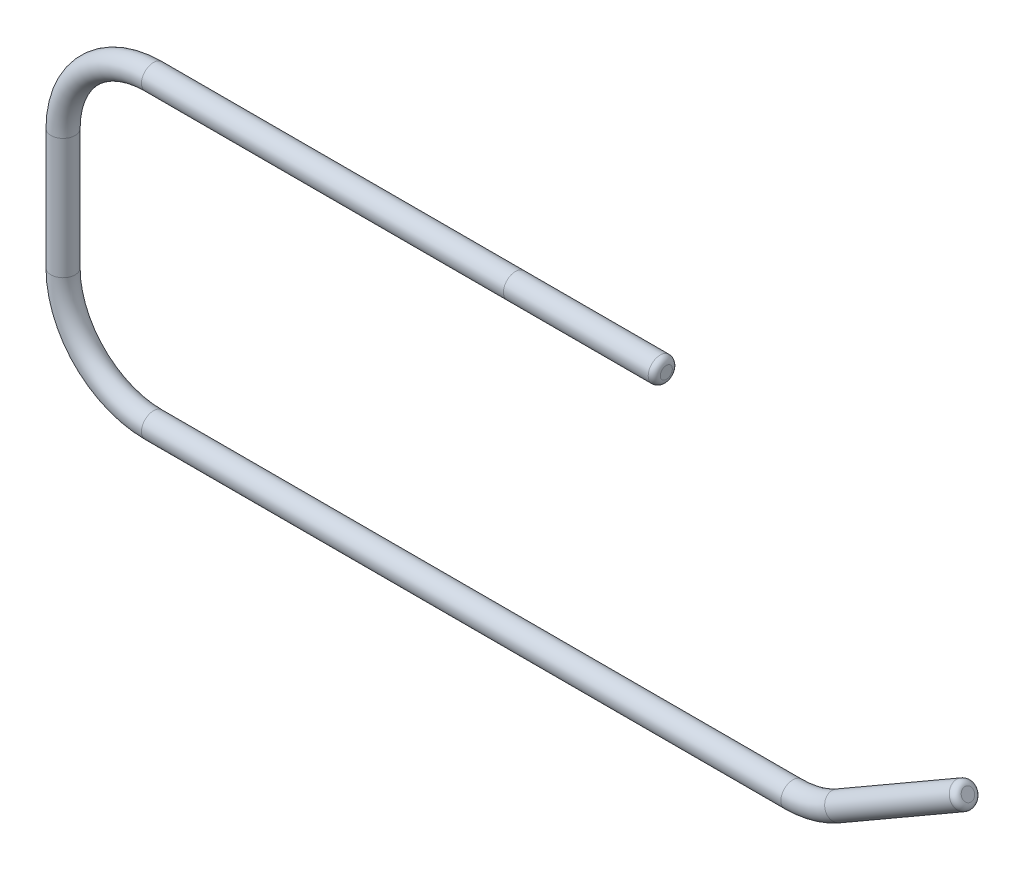
ISO-10303-21;
HEADER;
FILE_DESCRIPTION(('STEP AP214'),'2;1');
FILE_NAME('part.step','',(''),(''),'','','');
FILE_SCHEMA(('AUTOMOTIVE_DESIGN { 1 0 10303 214 1 1 1 1 }'));
ENDSEC;
DATA;
#1=APPLICATION_CONTEXT('core data for automotive mechanical design processes');
#2=APPLICATION_PROTOCOL_DEFINITION('international standard','automotive_design',2000,#1);
#3=PRODUCT_CONTEXT('',#1,'mechanical');
#4=PRODUCT('Part','Part','',(#3));
#5=PRODUCT_RELATED_PRODUCT_CATEGORY('part','',(#4));
#6=PRODUCT_DEFINITION_FORMATION('','',#4);
#7=PRODUCT_DEFINITION_CONTEXT('part definition',#1,'design');
#8=PRODUCT_DEFINITION('design','',#6,#7);
#9=PRODUCT_DEFINITION_SHAPE('','',#8);
#10=(LENGTH_UNIT() NAMED_UNIT(*) SI_UNIT(.MILLI.,.METRE.));
#11=(NAMED_UNIT(*) PLANE_ANGLE_UNIT() SI_UNIT($,.RADIAN.));
#12=(NAMED_UNIT(*) SI_UNIT($,.STERADIAN.) SOLID_ANGLE_UNIT());
#13=UNCERTAINTY_MEASURE_WITH_UNIT(LENGTH_MEASURE(1.E-05),#10,'distance_accuracy_value','');
#14=(GEOMETRIC_REPRESENTATION_CONTEXT(3) GLOBAL_UNCERTAINTY_ASSIGNED_CONTEXT((#13)) GLOBAL_UNIT_ASSIGNED_CONTEXT((#10,
#11,#12)) REPRESENTATION_CONTEXT('',''));
#15=CARTESIAN_POINT('',(0.,0.,0.));
#16=DIRECTION('',(0.,0.,1.));
#17=DIRECTION('',(1.,0.,0.));
#18=AXIS2_PLACEMENT_3D('',#15,#16,#17);
#19=CARTESIAN_POINT('',(50.,0.,0.));
#20=DIRECTION('',(1.,0.,0.));
#21=DIRECTION('',(0.,1.,0.));
#22=AXIS2_PLACEMENT_3D('',#19,#20,#21);
#23=PLANE('',#22);
#24=CARTESIAN_POINT('',(50.,0.,0.));
#25=DIRECTION('',(1.,0.,0.));
#26=DIRECTION('',(0.,1.,0.));
#27=AXIS2_PLACEMENT_3D('',#24,#25,#26);
#28=CIRCLE('',#27,2.);
#29=CARTESIAN_POINT('',(50.,2.,0.));
#30=VERTEX_POINT('',#29);
#31=EDGE_CURVE('E59',#30,#30,#28,.T.);
#32=ORIENTED_EDGE('',*,*,#31,.T.);
#33=EDGE_LOOP('',(#32));
#34=FACE_BOUND('',#33,.T.);
#35=ADVANCED_FACE('F44',(#34),#23,.T.);
#36=CARTESIAN_POINT('',(150.,-71.1324865405187,0.));
#37=DIRECTION('',(-0.866025403784438,-0.500000000000002,0.));
#38=DIRECTION('',(0.500000000000002,-0.866025403784438,0.));
#39=AXIS2_PLACEMENT_3D('',#36,#37,#38);
#40=PLANE('',#39);
#41=CARTESIAN_POINT('',(150.,-71.1324865405187,0.));
#42=DIRECTION('',(-0.866025403784438,-0.500000000000002,0.));
#43=DIRECTION('',(0.500000000000002,-0.866025403784438,0.));
#44=AXIS2_PLACEMENT_3D('',#41,#42,#43);
#45=CIRCLE('',#44,2.);
#46=CARTESIAN_POINT('',(151.,-72.8645373480875,0.));
#47=VERTEX_POINT('',#46);
#48=EDGE_CURVE('E11',#47,#47,#45,.F.);
#49=ORIENTED_EDGE('',*,*,#48,.T.);
#50=EDGE_LOOP('',(#49));
#51=FACE_BOUND('',#50,.T.);
#52=ADVANCED_FACE('F100',(#51),#40,.F.);
#53=CARTESIAN_POINT('',(50.,0.,0.));
#54=DIRECTION('',(-1.,0.,0.));
#55=DIRECTION('',(0.,-1.,0.));
#56=AXIS2_PLACEMENT_3D('',#53,#54,#55);
#57=CYLINDRICAL_SURFACE('',#56,4.);
#58=CARTESIAN_POINT('',(48.,0.,0.));
#59=DIRECTION('',(1.,0.,0.));
#60=DIRECTION('',(0.,1.,0.));
#61=AXIS2_PLACEMENT_3D('',#58,#59,#60);
#62=CIRCLE('',#61,4.);
#63=CARTESIAN_POINT('',(48.,4.,0.));
#64=VERTEX_POINT('',#63);
#65=EDGE_CURVE('E55',#64,#64,#62,.F.);
#66=ORIENTED_EDGE('',*,*,#65,.T.);
#67=EDGE_LOOP('',(#66));
#68=FACE_BOUND('',#67,.T.);
#69=CARTESIAN_POINT('',(0.,0.,0.));
#70=DIRECTION('',(1.,0.,0.));
#71=DIRECTION('',(0.,1.,0.));
#72=AXIS2_PLACEMENT_3D('',#69,#70,#71);
#73=CIRCLE('',#72,4.);
#74=CARTESIAN_POINT('',(0.,4.,0.));
#75=VERTEX_POINT('',#74);
#76=EDGE_CURVE('E82',#75,#75,#73,.T.);
#77=ORIENTED_EDGE('',*,*,#76,.T.);
#78=EDGE_LOOP('',(#77));
#79=FACE_BOUND('',#78,.T.);
#80=ADVANCED_FACE('F86',(#68,#79),#57,.T.);
#81=CARTESIAN_POINT('',(0.,0.,0.));
#82=DIRECTION('',(-1.,0.,0.));
#83=DIRECTION('',(0.,0.,1.));
#84=AXIS2_PLACEMENT_3D('',#81,#82,#83);
#85=CYLINDRICAL_SURFACE('',#84,4.);
#86=CARTESIAN_POINT('',(-120.,0.,0.));
#87=DIRECTION('',(1.,0.,0.));
#88=DIRECTION('',(0.,1.,0.));
#89=AXIS2_PLACEMENT_3D('',#86,#87,#88);
#90=CIRCLE('',#89,4.);
#91=CARTESIAN_POINT('',(-120.,3.99999999999999,0.));
#92=VERTEX_POINT('',#91);
#93=EDGE_CURVE('E79',#92,#92,#90,.T.);
#94=ORIENTED_EDGE('',*,*,#93,.T.);
#95=EDGE_LOOP('',(#94));
#96=FACE_BOUND('',#95,.T.);
#97=ORIENTED_EDGE('',*,*,#76,.F.);
#98=EDGE_LOOP('',(#97));
#99=FACE_BOUND('',#98,.T.);
#100=ADVANCED_FACE('F88',(#96,#99),#85,.T.);
#101=CARTESIAN_POINT('',(-120.,-30.,0.));
#102=DIRECTION('',(0.,0.,1.));
#103=DIRECTION('',(1.,0.,0.));
#104=AXIS2_PLACEMENT_3D('',#101,#102,#103);
#105=TOROIDAL_SURFACE('',#104,30.,4.);
#106=CARTESIAN_POINT('',(-150.,-30.0000000000002,0.));
#107=DIRECTION('',(0.,1.,0.));
#108=DIRECTION('',(-1.,0.,0.));
#109=AXIS2_PLACEMENT_3D('',#106,#107,#108);
#110=CIRCLE('',#109,4.);
#111=CARTESIAN_POINT('',(-154.,-30.0000000000002,0.));
#112=VERTEX_POINT('',#111);
#113=EDGE_CURVE('E76',#112,#112,#110,.T.);
#114=CARTESIAN_POINT('',(-120.,-30.,0.));
#115=DIRECTION('',(0.,0.,1.));
#116=DIRECTION('',(1.,0.,0.));
#117=AXIS2_PLACEMENT_3D('',#114,#115,#116);
#118=CIRCLE('',#117,34.);
#119=EDGE_CURVE('',#92,#112,#118,.T.);
#120=ORIENTED_EDGE('',*,*,#93,.F.);
#121=ORIENTED_EDGE('',*,*,#113,.T.);
#122=ORIENTED_EDGE('',*,*,#119,.T.);
#123=ORIENTED_EDGE('',*,*,#119,.F.);
#124=EDGE_LOOP('',(#120,#122,#121,#123));
#125=FACE_BOUND('',#124,.T.);
#126=ADVANCED_FACE('F90',(#125),#105,.T.);
#127=CARTESIAN_POINT('',(-150.,-30.0000000000002,0.));
#128=DIRECTION('',(0.,-1.,0.));
#129=DIRECTION('',(1.,0.,0.));
#130=AXIS2_PLACEMENT_3D('',#127,#128,#129);
#131=CYLINDRICAL_SURFACE('',#130,4.);
#132=CARTESIAN_POINT('',(-150.,-69.9999999999998,0.));
#133=DIRECTION('',(0.,1.,0.));
#134=DIRECTION('',(-1.,0.,0.));
#135=AXIS2_PLACEMENT_3D('',#132,#133,#134);
#136=CIRCLE('',#135,4.);
#137=CARTESIAN_POINT('',(-154.,-69.9999999999998,0.));
#138=VERTEX_POINT('',#137);
#139=EDGE_CURVE('E73',#138,#138,#136,.T.);
#140=ORIENTED_EDGE('',*,*,#139,.T.);
#141=EDGE_LOOP('',(#140));
#142=FACE_BOUND('',#141,.T.);
#143=ORIENTED_EDGE('',*,*,#113,.F.);
#144=EDGE_LOOP('',(#143));
#145=FACE_BOUND('',#144,.T.);
#146=ADVANCED_FACE('F97',(#142,#145),#131,.T.);
#147=CARTESIAN_POINT('',(-120.,-70.,0.));
#148=DIRECTION('',(0.,0.,1.));
#149=DIRECTION('',(1.,0.,0.));
#150=AXIS2_PLACEMENT_3D('',#147,#148,#149);
#151=TOROIDAL_SURFACE('',#150,30.,4.);
#152=CARTESIAN_POINT('',(-120.,-100.,0.));
#153=DIRECTION('',(-1.,0.,0.));
#154=DIRECTION('',(0.,-1.,0.));
#155=AXIS2_PLACEMENT_3D('',#152,#153,#154);
#156=CIRCLE('',#155,4.);
#157=CARTESIAN_POINT('',(-120.,-104.,0.));
#158=VERTEX_POINT('',#157);
#159=EDGE_CURVE('E70',#158,#158,#156,.T.);
#160=CARTESIAN_POINT('',(-120.,-70.,0.));
#161=DIRECTION('',(0.,0.,1.));
#162=DIRECTION('',(1.,0.,0.));
#163=AXIS2_PLACEMENT_3D('',#160,#161,#162);
#164=CIRCLE('',#163,34.);
#165=EDGE_CURVE('',#138,#158,#164,.T.);
#166=ORIENTED_EDGE('',*,*,#139,.F.);
#167=ORIENTED_EDGE('',*,*,#159,.T.);
#168=ORIENTED_EDGE('',*,*,#165,.T.);
#169=ORIENTED_EDGE('',*,*,#165,.F.);
#170=EDGE_LOOP('',(#166,#168,#167,#169));
#171=FACE_BOUND('',#170,.T.);
#172=ADVANCED_FACE('F170',(#171),#151,.T.);
#173=CARTESIAN_POINT('',(-120.,-100.,0.));
#174=DIRECTION('',(1.,0.,0.));
#175=DIRECTION('',(0.,0.,-1.));
#176=AXIS2_PLACEMENT_3D('',#173,#174,#175);
#177=CYLINDRICAL_SURFACE('',#176,4.);
#178=CARTESIAN_POINT('',(91.9615242270662,-100.,0.));
#179=DIRECTION('',(-1.,0.,0.));
#180=DIRECTION('',(0.,-1.,0.));
#181=AXIS2_PLACEMENT_3D('',#178,#179,#180);
#182=CIRCLE('',#181,4.);
#183=CARTESIAN_POINT('',(91.9615242270662,-104.,0.));
#184=VERTEX_POINT('',#183);
#185=EDGE_CURVE('E67',#184,#184,#182,.T.);
#186=ORIENTED_EDGE('',*,*,#185,.T.);
#187=EDGE_LOOP('',(#186));
#188=FACE_BOUND('',#187,.T.);
#189=ORIENTED_EDGE('',*,*,#159,.F.);
#190=EDGE_LOOP('',(#189));
#191=FACE_BOUND('',#190,.T.);
#192=ADVANCED_FACE('F113',(#188,#191),#177,.T.);
#193=CARTESIAN_POINT('',(91.9615242270663,-70.,0.));
#194=DIRECTION('',(0.,0.,1.));
#195=DIRECTION('',(1.,0.,0.));
#196=AXIS2_PLACEMENT_3D('',#193,#194,#195);
#197=TOROIDAL_SURFACE('',#196,30.,4.);
#198=CARTESIAN_POINT('',(106.961524227066,-95.9807621135337,0.));
#199=DIRECTION('',(-0.866025403784438,-0.500000000000002,0.));
#200=DIRECTION('',(0.500000000000002,-0.866025403784438,0.));
#201=AXIS2_PLACEMENT_3D('',#198,#199,#200);
#202=CIRCLE('',#201,4.);
#203=CARTESIAN_POINT('',(108.961524227066,-99.4448637286711,0.));
#204=VERTEX_POINT('',#203);
#205=EDGE_CURVE('E64',#204,#204,#202,.T.);
#206=CARTESIAN_POINT('',(91.9615242270663,-70.,0.));
#207=DIRECTION('',(0.,0.,1.));
#208=DIRECTION('',(1.,0.,0.));
#209=AXIS2_PLACEMENT_3D('',#206,#207,#208);
#210=CIRCLE('',#209,34.);
#211=EDGE_CURVE('',#184,#204,#210,.T.);
#212=ORIENTED_EDGE('',*,*,#185,.F.);
#213=ORIENTED_EDGE('',*,*,#205,.T.);
#214=ORIENTED_EDGE('',*,*,#211,.T.);
#215=ORIENTED_EDGE('',*,*,#211,.F.);
#216=EDGE_LOOP('',(#212,#214,#213,#215));
#217=FACE_BOUND('',#216,.T.);
#218=ADVANCED_FACE('F106',(#217),#197,.T.);
#219=CARTESIAN_POINT('',(106.961524227066,-95.9807621135331,0.));
#220=DIRECTION('',(0.866025403784438,0.500000000000001,0.));
#221=DIRECTION('',(-0.500000000000001,0.866025403784438,0.));
#222=AXIS2_PLACEMENT_3D('',#219,#220,#221);
#223=CYLINDRICAL_SURFACE('',#222,4.);
#224=CARTESIAN_POINT('',(148.267949192431,-72.1324865405187,0.));
#225=DIRECTION('',(-0.866025403784438,-0.500000000000002,0.));
#226=DIRECTION('',(0.500000000000002,-0.866025403784438,0.));
#227=AXIS2_PLACEMENT_3D('',#224,#225,#226);
#228=CIRCLE('',#227,4.);
#229=CARTESIAN_POINT('',(150.267949192431,-75.5965881556564,0.));
#230=VERTEX_POINT('',#229);
#231=EDGE_CURVE('E51',#230,#230,#228,.T.);
#232=ORIENTED_EDGE('',*,*,#231,.T.);
#233=EDGE_LOOP('',(#232));
#234=FACE_BOUND('',#233,.T.);
#235=ORIENTED_EDGE('',*,*,#205,.F.);
#236=EDGE_LOOP('',(#235));
#237=FACE_BOUND('',#236,.T.);
#238=ADVANCED_FACE('F103',(#234,#237),#223,.T.);
#239=CARTESIAN_POINT('',(48.,0.,0.));
#240=DIRECTION('',(1.,0.,0.));
#241=DIRECTION('',(0.,1.,0.));
#242=AXIS2_PLACEMENT_3D('',#239,#240,#241);
#243=DEGENERATE_TOROIDAL_SURFACE('',#242,2.,2.,.T.);
#244=ORIENTED_EDGE('',*,*,#65,.F.);
#245=EDGE_LOOP('',(#244));
#246=FACE_BOUND('',#245,.T.);
#247=ORIENTED_EDGE('',*,*,#31,.F.);
#248=EDGE_LOOP('',(#247));
#249=FACE_BOUND('',#248,.T.);
#250=ADVANCED_FACE('F105',(#246,#249),#243,.T.);
#251=CARTESIAN_POINT('',(148.267949192431,-72.1324865405187,0.));
#252=DIRECTION('',(-0.866025403784438,-0.500000000000002,0.));
#253=DIRECTION('',(0.500000000000002,-0.866025403784438,0.));
#254=AXIS2_PLACEMENT_3D('',#251,#252,#253);
#255=DEGENERATE_TOROIDAL_SURFACE('',#254,2.,2.,.T.);
#256=ORIENTED_EDGE('',*,*,#48,.F.);
#257=EDGE_LOOP('',(#256));
#258=FACE_BOUND('',#257,.T.);
#259=ORIENTED_EDGE('',*,*,#231,.F.);
#260=EDGE_LOOP('',(#259));
#261=FACE_BOUND('',#260,.T.);
#262=ADVANCED_FACE('F46',(#258,#261),#255,.T.);
#263=CLOSED_SHELL('',(#35,#52,#80,#100,#126,#146,#172,#192,#218,#238,#250,#262));
#264=MANIFOLD_SOLID_BREP('B2',#263);
#265=ADVANCED_BREP_SHAPE_REPRESENTATION('',(#18,#264),#14);
#266=SHAPE_DEFINITION_REPRESENTATION(#9,#265);
ENDSEC;
END-ISO-10303-21;
